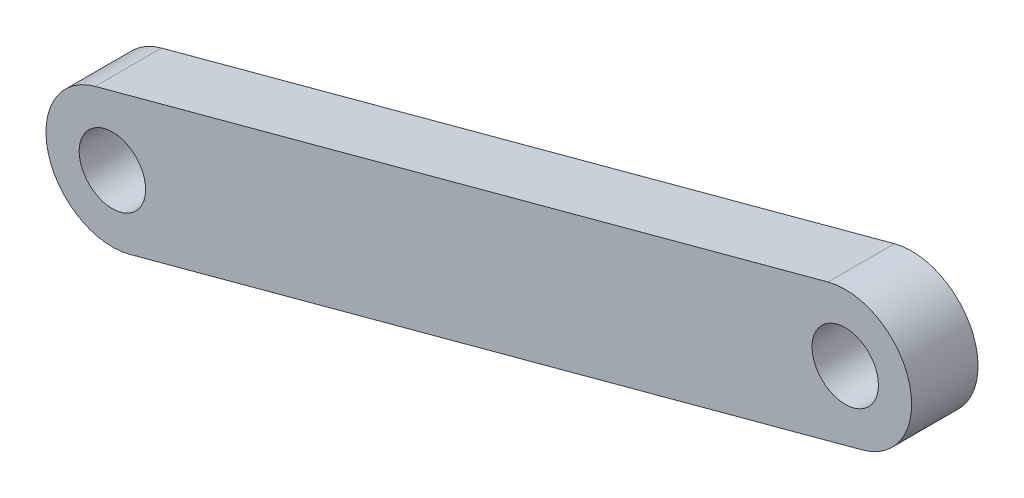
ISO-10303-21;
HEADER;
FILE_DESCRIPTION(('STEP AP214'),'2;1');
FILE_NAME('part.step','',(''),(''),'','','');
FILE_SCHEMA(('AUTOMOTIVE_DESIGN { 1 0 10303 214 1 1 1 1 }'));
ENDSEC;
DATA;
#1=APPLICATION_CONTEXT('core data for automotive mechanical design processes');
#2=APPLICATION_PROTOCOL_DEFINITION('international standard','automotive_design',2000,#1);
#3=PRODUCT_CONTEXT('',#1,'mechanical');
#4=PRODUCT('Part','Part','',(#3));
#5=PRODUCT_RELATED_PRODUCT_CATEGORY('part','',(#4));
#6=PRODUCT_DEFINITION_FORMATION('','',#4);
#7=PRODUCT_DEFINITION_CONTEXT('part definition',#1,'design');
#8=PRODUCT_DEFINITION('design','',#6,#7);
#9=PRODUCT_DEFINITION_SHAPE('','',#8);
#10=(LENGTH_UNIT() NAMED_UNIT(*) SI_UNIT(.MILLI.,.METRE.));
#11=(NAMED_UNIT(*) PLANE_ANGLE_UNIT() SI_UNIT($,.RADIAN.));
#12=(NAMED_UNIT(*) SI_UNIT($,.STERADIAN.) SOLID_ANGLE_UNIT());
#13=UNCERTAINTY_MEASURE_WITH_UNIT(LENGTH_MEASURE(1.E-05),#10,'distance_accuracy_value','');
#14=(GEOMETRIC_REPRESENTATION_CONTEXT(3) GLOBAL_UNCERTAINTY_ASSIGNED_CONTEXT((#13)) GLOBAL_UNIT_ASSIGNED_CONTEXT((#10,
#11,#12)) REPRESENTATION_CONTEXT('',''));
#15=CARTESIAN_POINT('',(0.,0.,0.));
#16=DIRECTION('',(0.,0.,1.));
#17=DIRECTION('',(1.,0.,0.));
#18=AXIS2_PLACEMENT_3D('',#15,#16,#17);
#19=CARTESIAN_POINT('',(50.8,40.6399999999999,3.));
#20=DIRECTION('',(0.,0.,-1.));
#21=DIRECTION('',(-1.,0.,0.));
#22=AXIS2_PLACEMENT_3D('',#19,#20,#21);
#23=CYLINDRICAL_SURFACE('',#22,3.);
#24=CARTESIAN_POINT('',(50.8,40.6399999999999,0.));
#25=DIRECTION('',(0.,0.,1.));
#26=DIRECTION('',(1.,0.,0.));
#27=AXIS2_PLACEMENT_3D('',#24,#25,#26);
#28=CIRCLE('',#27,3.);
#29=CARTESIAN_POINT('',(50.0212199283099,43.5371540518133,0.));
#30=VERTEX_POINT('',#29);
#31=CARTESIAN_POINT('',(51.5787800716901,37.7428459481866,0.));
#32=VERTEX_POINT('',#31);
#33=EDGE_CURVE('E112',#30,#32,#28,.T.);
#34=ORIENTED_EDGE('',*,*,#33,.T.);
#35=DIRECTION('',(0.,0.,-1.));
#36=VECTOR('',#35,1.);
#37=CARTESIAN_POINT('',(51.5787800716901,37.7428459481866,3.));
#38=LINE('',#37,#36);
#39=CARTESIAN_POINT('',(51.5787800716901,37.7428459481866,3.));
#40=VERTEX_POINT('',#39);
#41=EDGE_CURVE('E11',#40,#32,#38,.T.);
#42=ORIENTED_EDGE('',*,*,#41,.F.);
#43=CARTESIAN_POINT('',(50.8,40.6399999999999,3.));
#44=DIRECTION('',(0.,0.,1.));
#45=DIRECTION('',(1.,0.,0.));
#46=AXIS2_PLACEMENT_3D('',#43,#44,#45);
#47=CIRCLE('',#46,3.);
#48=CARTESIAN_POINT('',(50.0212199283099,43.5371540518133,3.));
#49=VERTEX_POINT('',#48);
#50=EDGE_CURVE('E92',#49,#40,#47,.T.);
#51=ORIENTED_EDGE('',*,*,#50,.F.);
#52=DIRECTION('',(0.,0.,-1.));
#53=VECTOR('',#52,1.);
#54=CARTESIAN_POINT('',(50.0212199283099,43.5371540518133,3.));
#55=LINE('',#54,#53);
#56=EDGE_CURVE('E58',#49,#30,#55,.T.);
#57=ORIENTED_EDGE('',*,*,#56,.T.);
#58=EDGE_LOOP('',(#34,#42,#51,#57));
#59=FACE_BOUND('',#58,.T.);
#60=ADVANCED_FACE('F41',(#59),#23,.T.);
#61=CARTESIAN_POINT('',(-5.98607684178934,22.2689144305124,3.));
#62=DIRECTION('',(-0.259593357230044,0.965718017271105,0.));
#63=DIRECTION('',(-0.965718017271105,-0.259593357230044,0.));
#64=AXIS2_PLACEMENT_3D('',#61,#62,#63);
#65=PLANE('',#64);
#66=DIRECTION('',(0.965718017271105,0.259593357230044,0.));
#67=VECTOR('',#66,1.);
#68=CARTESIAN_POINT('',(-5.98607684178934,22.2689144305124,0.));
#69=LINE('',#68,#67);
#70=CARTESIAN_POINT('',(84.6932508839163,46.6443021676048,0.));
#71=VERTEX_POINT('',#70);
#72=EDGE_CURVE('E97',#32,#71,#69,.T.);
#73=ORIENTED_EDGE('',*,*,#72,.T.);
#74=DIRECTION('',(0.,0.,-1.));
#75=VECTOR('',#74,1.);
#76=CARTESIAN_POINT('',(84.6932508839163,46.6443021676048,3.));
#77=LINE('',#76,#75);
#78=CARTESIAN_POINT('',(84.6932508839163,46.6443021676048,3.));
#79=VERTEX_POINT('',#78);
#80=EDGE_CURVE('E50',#79,#71,#77,.T.);
#81=ORIENTED_EDGE('',*,*,#80,.F.);
#82=DIRECTION('',(0.965718017271105,0.259593357230044,0.));
#83=VECTOR('',#82,1.);
#84=CARTESIAN_POINT('',(-5.98607684178934,22.2689144305124,3.));
#85=LINE('',#84,#83);
#86=EDGE_CURVE('E84',#40,#79,#85,.T.);
#87=ORIENTED_EDGE('',*,*,#86,.F.);
#88=ORIENTED_EDGE('',*,*,#41,.T.);
#89=EDGE_LOOP('',(#73,#81,#87,#88));
#90=FACE_BOUND('',#89,.T.);
#91=ADVANCED_FACE('F96',(#90),#65,.F.);
#92=CARTESIAN_POINT('',(83.9144708122262,49.5414562194182,3.));
#93=DIRECTION('',(0.,0.,-1.));
#94=DIRECTION('',(-1.,0.,0.));
#95=AXIS2_PLACEMENT_3D('',#92,#93,#94);
#96=CYLINDRICAL_SURFACE('',#95,3.00000000000001);
#97=CARTESIAN_POINT('',(83.9144708122262,49.5414562194182,0.));
#98=DIRECTION('',(0.,0.,1.));
#99=DIRECTION('',(1.,0.,0.));
#100=AXIS2_PLACEMENT_3D('',#97,#98,#99);
#101=CIRCLE('',#100,3.00000000000001);
#102=CARTESIAN_POINT('',(83.1356907405361,52.4386102712315,0.));
#103=VERTEX_POINT('',#102);
#104=EDGE_CURVE('E115',#71,#103,#101,.T.);
#105=ORIENTED_EDGE('',*,*,#104,.T.);
#106=DIRECTION('',(0.,0.,-1.));
#107=VECTOR('',#106,1.);
#108=CARTESIAN_POINT('',(83.1356907405361,52.4386102712315,3.));
#109=LINE('',#108,#107);
#110=CARTESIAN_POINT('',(83.1356907405361,52.4386102712315,3.));
#111=VERTEX_POINT('',#110);
#112=EDGE_CURVE('E73',#111,#103,#109,.T.);
#113=ORIENTED_EDGE('',*,*,#112,.F.);
#114=CARTESIAN_POINT('',(83.9144708122262,49.5414562194182,3.));
#115=DIRECTION('',(0.,0.,1.));
#116=DIRECTION('',(1.,0.,0.));
#117=AXIS2_PLACEMENT_3D('',#114,#115,#116);
#118=CIRCLE('',#117,3.00000000000001);
#119=EDGE_CURVE('E91',#79,#111,#118,.T.);
#120=ORIENTED_EDGE('',*,*,#119,.F.);
#121=ORIENTED_EDGE('',*,*,#80,.T.);
#122=EDGE_LOOP('',(#105,#113,#120,#121));
#123=FACE_BOUND('',#122,.T.);
#124=ADVANCED_FACE('F100',(#123),#96,.T.);
#125=CARTESIAN_POINT('',(-7.54363698516961,28.063222534139,3.));
#126=DIRECTION('',(-0.259593357230044,0.965718017271105,0.));
#127=DIRECTION('',(-0.965718017271105,-0.259593357230044,0.));
#128=AXIS2_PLACEMENT_3D('',#125,#126,#127);
#129=PLANE('',#128);
#130=DIRECTION('',(0.965718017271105,0.259593357230044,0.));
#131=VECTOR('',#130,1.);
#132=CARTESIAN_POINT('',(-7.54363698516961,28.063222534139,0.));
#133=LINE('',#132,#131);
#134=EDGE_CURVE('E117',#30,#103,#133,.T.);
#135=ORIENTED_EDGE('',*,*,#134,.F.);
#136=ORIENTED_EDGE('',*,*,#56,.F.);
#137=DIRECTION('',(0.965718017271105,0.259593357230044,0.));
#138=VECTOR('',#137,1.);
#139=CARTESIAN_POINT('',(-7.54363698516961,28.063222534139,3.));
#140=LINE('',#139,#138);
#141=EDGE_CURVE('E101',#49,#111,#140,.T.);
#142=ORIENTED_EDGE('',*,*,#141,.T.);
#143=ORIENTED_EDGE('',*,*,#112,.T.);
#144=EDGE_LOOP('',(#135,#136,#142,#143));
#145=FACE_BOUND('',#144,.T.);
#146=ADVANCED_FACE('F153',(#145),#129,.T.);
#147=CARTESIAN_POINT('',(50.8,40.6399999999999,3.));
#148=DIRECTION('',(0.,0.,-1.));
#149=DIRECTION('',(-1.,0.,0.));
#150=AXIS2_PLACEMENT_3D('',#147,#148,#149);
#151=CYLINDRICAL_SURFACE('',#150,1.5);
#152=CARTESIAN_POINT('',(50.8,40.6399999999999,3.));
#153=DIRECTION('',(0.,0.,1.));
#154=DIRECTION('',(1.,0.,0.));
#155=AXIS2_PLACEMENT_3D('',#152,#153,#154);
#156=CIRCLE('',#155,1.5);
#157=CARTESIAN_POINT('',(52.3,40.6399999999999,3.));
#158=VERTEX_POINT('',#157);
#159=EDGE_CURVE('E123',#158,#158,#156,.T.);
#160=ORIENTED_EDGE('',*,*,#159,.T.);
#161=EDGE_LOOP('',(#160));
#162=FACE_BOUND('',#161,.T.);
#163=CARTESIAN_POINT('',(50.8,40.6399999999999,0.));
#164=DIRECTION('',(0.,0.,1.));
#165=DIRECTION('',(1.,0.,0.));
#166=AXIS2_PLACEMENT_3D('',#163,#164,#165);
#167=CIRCLE('',#166,1.5);
#168=CARTESIAN_POINT('',(52.3,40.6399999999999,0.));
#169=VERTEX_POINT('',#168);
#170=EDGE_CURVE('E109',#169,#169,#167,.T.);
#171=ORIENTED_EDGE('',*,*,#170,.F.);
#172=EDGE_LOOP('',(#171));
#173=FACE_BOUND('',#172,.T.);
#174=ADVANCED_FACE('F43',(#162,#173),#151,.F.);
#175=CARTESIAN_POINT('',(83.9144708122262,49.5414562194182,3.));
#176=DIRECTION('',(0.,0.,-1.));
#177=DIRECTION('',(-1.,0.,0.));
#178=AXIS2_PLACEMENT_3D('',#175,#176,#177);
#179=CYLINDRICAL_SURFACE('',#178,1.5);
#180=CARTESIAN_POINT('',(83.9144708122262,49.5414562194182,3.));
#181=DIRECTION('',(0.,0.,1.));
#182=DIRECTION('',(1.,0.,0.));
#183=AXIS2_PLACEMENT_3D('',#180,#181,#182);
#184=CIRCLE('',#183,1.5);
#185=CARTESIAN_POINT('',(85.4144708122262,49.5414562194182,3.));
#186=VERTEX_POINT('',#185);
#187=EDGE_CURVE('E103',#186,#186,#184,.T.);
#188=ORIENTED_EDGE('',*,*,#187,.T.);
#189=EDGE_LOOP('',(#188));
#190=FACE_BOUND('',#189,.T.);
#191=CARTESIAN_POINT('',(83.9144708122262,49.5414562194182,0.));
#192=DIRECTION('',(0.,0.,1.));
#193=DIRECTION('',(1.,0.,0.));
#194=AXIS2_PLACEMENT_3D('',#191,#192,#193);
#195=CIRCLE('',#194,1.5);
#196=CARTESIAN_POINT('',(85.4144708122262,49.5414562194182,0.));
#197=VERTEX_POINT('',#196);
#198=EDGE_CURVE('E120',#197,#197,#195,.T.);
#199=ORIENTED_EDGE('',*,*,#198,.F.);
#200=EDGE_LOOP('',(#199));
#201=FACE_BOUND('',#200,.T.);
#202=ADVANCED_FACE('F135',(#190,#201),#179,.F.);
#203=CARTESIAN_POINT('',(0.,0.,3.));
#204=DIRECTION('',(0.,0.,1.));
#205=DIRECTION('',(1.,0.,0.));
#206=AXIS2_PLACEMENT_3D('',#203,#204,#205);
#207=PLANE('',#206);
#208=ORIENTED_EDGE('',*,*,#159,.F.);
#209=EDGE_LOOP('',(#208));
#210=FACE_BOUND('',#209,.T.);
#211=ORIENTED_EDGE('',*,*,#50,.T.);
#212=ORIENTED_EDGE('',*,*,#86,.T.);
#213=ORIENTED_EDGE('',*,*,#119,.T.);
#214=ORIENTED_EDGE('',*,*,#141,.F.);
#215=EDGE_LOOP('',(#211,#212,#213,#214));
#216=FACE_BOUND('',#215,.T.);
#217=ORIENTED_EDGE('',*,*,#187,.F.);
#218=EDGE_LOOP('',(#217));
#219=FACE_BOUND('',#218,.T.);
#220=ADVANCED_FACE('F87',(#210,#216,#219),#207,.T.);
#221=CARTESIAN_POINT('',(0.,0.,0.));
#222=DIRECTION('',(0.,0.,1.));
#223=DIRECTION('',(1.,0.,0.));
#224=AXIS2_PLACEMENT_3D('',#221,#222,#223);
#225=PLANE('',#224);
#226=ORIENTED_EDGE('',*,*,#170,.T.);
#227=EDGE_LOOP('',(#226));
#228=FACE_BOUND('',#227,.T.);
#229=ORIENTED_EDGE('',*,*,#33,.F.);
#230=ORIENTED_EDGE('',*,*,#134,.T.);
#231=ORIENTED_EDGE('',*,*,#104,.F.);
#232=ORIENTED_EDGE('',*,*,#72,.F.);
#233=EDGE_LOOP('',(#229,#230,#231,#232));
#234=FACE_BOUND('',#233,.T.);
#235=ORIENTED_EDGE('',*,*,#198,.T.);
#236=EDGE_LOOP('',(#235));
#237=FACE_BOUND('',#236,.T.);
#238=ADVANCED_FACE('F134',(#228,#234,#237),#225,.F.);
#239=CLOSED_SHELL('',(#60,#91,#124,#146,#174,#202,#220,#238));
#240=MANIFOLD_SOLID_BREP('B2',#239);
#241=ADVANCED_BREP_SHAPE_REPRESENTATION('',(#18,#240),#14);
#242=SHAPE_DEFINITION_REPRESENTATION(#9,#241);
ENDSEC;
END-ISO-10303-21;
